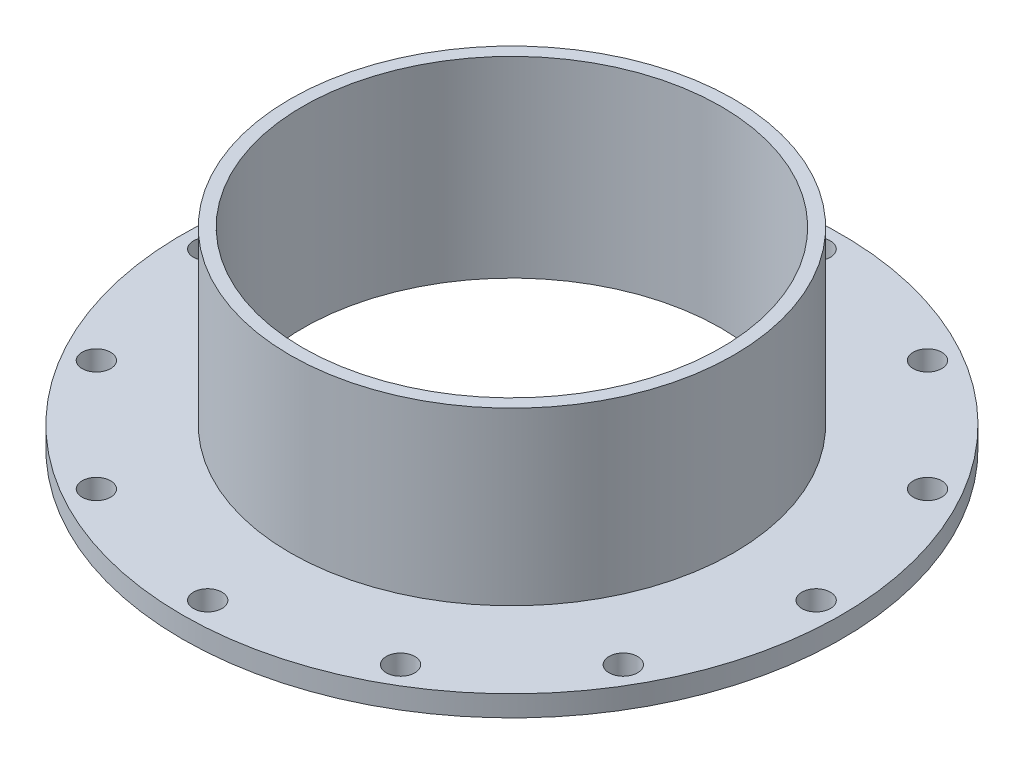
ISO-10303-21;
HEADER;
FILE_DESCRIPTION(('STEP AP214'),'2;1');
FILE_NAME('part.step','',(''),(''),'','','');
FILE_SCHEMA(('AUTOMOTIVE_DESIGN { 1 0 10303 214 1 1 1 1 }'));
ENDSEC;
DATA;
#1=APPLICATION_CONTEXT('core data for automotive mechanical design processes');
#2=APPLICATION_PROTOCOL_DEFINITION('international standard','automotive_design',2000,#1);
#3=PRODUCT_CONTEXT('',#1,'mechanical');
#4=PRODUCT('Part','Part','',(#3));
#5=PRODUCT_RELATED_PRODUCT_CATEGORY('part','',(#4));
#6=PRODUCT_DEFINITION_FORMATION('','',#4);
#7=PRODUCT_DEFINITION_CONTEXT('part definition',#1,'design');
#8=PRODUCT_DEFINITION('design','',#6,#7);
#9=PRODUCT_DEFINITION_SHAPE('','',#8);
#10=(LENGTH_UNIT() NAMED_UNIT(*) SI_UNIT(.MILLI.,.METRE.));
#11=(NAMED_UNIT(*) PLANE_ANGLE_UNIT() SI_UNIT($,.RADIAN.));
#12=(NAMED_UNIT(*) SI_UNIT($,.STERADIAN.) SOLID_ANGLE_UNIT());
#13=UNCERTAINTY_MEASURE_WITH_UNIT(LENGTH_MEASURE(1.E-05),#10,'distance_accuracy_value','');
#14=(GEOMETRIC_REPRESENTATION_CONTEXT(3) GLOBAL_UNCERTAINTY_ASSIGNED_CONTEXT((#13)) GLOBAL_UNIT_ASSIGNED_CONTEXT((#10,
#11,#12)) REPRESENTATION_CONTEXT('',''));
#15=CARTESIAN_POINT('',(0.,0.,0.));
#16=DIRECTION('',(0.,0.,1.));
#17=DIRECTION('',(1.,0.,0.));
#18=AXIS2_PLACEMENT_3D('',#15,#16,#17);
#19=CARTESIAN_POINT('',(0.,3.3,0.));
#20=DIRECTION('',(0.,1.,0.));
#21=DIRECTION('',(0.,0.,1.));
#22=AXIS2_PLACEMENT_3D('',#19,#20,#21);
#23=PLANE('',#22);
#24=CARTESIAN_POINT('',(-41.5692193816531,3.3,-23.9999999999999));
#25=DIRECTION('',(0.,1.,0.));
#26=DIRECTION('',(0.86602540378444,0.,0.499999999999998));
#27=AXIS2_PLACEMENT_3D('',#24,#25,#26);
#28=CIRCLE('',#27,2.25);
#29=CARTESIAN_POINT('',(-39.6206622231381,3.3,-22.8749999999999));
#30=VERTEX_POINT('',#29);
#31=EDGE_CURVE('E111',#30,#30,#28,.T.);
#32=ORIENTED_EDGE('',*,*,#31,.F.);
#33=EDGE_LOOP('',(#32));
#34=FACE_BOUND('',#33,.T.);
#35=CARTESIAN_POINT('',(-48.,3.3,1.6759110426447E-13));
#36=DIRECTION('',(0.,1.,0.));
#37=DIRECTION('',(1.,0.,0.));
#38=AXIS2_PLACEMENT_3D('',#35,#36,#37);
#39=CIRCLE('',#38,2.25);
#40=CARTESIAN_POINT('',(-45.75,3.3,1.59735271252073E-13));
#41=VERTEX_POINT('',#40);
#42=EDGE_CURVE('E105',#41,#41,#39,.T.);
#43=ORIENTED_EDGE('',*,*,#42,.F.);
#44=EDGE_LOOP('',(#43));
#45=FACE_BOUND('',#44,.T.);
#46=CARTESIAN_POINT('',(-41.5692193816529,3.3,24.0000000000002));
#47=DIRECTION('',(0.,1.,0.));
#48=DIRECTION('',(0.866025403784436,0.,-0.500000000000004));
#49=AXIS2_PLACEMENT_3D('',#46,#47,#48);
#50=CIRCLE('',#49,2.25);
#51=CARTESIAN_POINT('',(-39.620662223138,3.3,22.8750000000002));
#52=VERTEX_POINT('',#51);
#53=EDGE_CURVE('E99',#52,#52,#50,.T.);
#54=ORIENTED_EDGE('',*,*,#53,.F.);
#55=EDGE_LOOP('',(#54));
#56=FACE_BOUND('',#55,.T.);
#57=CARTESIAN_POINT('',(-23.9999999999998,3.3,41.5692193816532));
#58=DIRECTION('',(0.,1.,0.));
#59=DIRECTION('',(0.499999999999995,0.,-0.866025403784442));
#60=AXIS2_PLACEMENT_3D('',#57,#58,#59);
#61=CIRCLE('',#60,2.25);
#62=CARTESIAN_POINT('',(-22.8749999999998,3.3,39.6206622231382));
#63=VERTEX_POINT('',#62);
#64=EDGE_CURVE('E93',#63,#63,#61,.T.);
#65=ORIENTED_EDGE('',*,*,#64,.F.);
#66=EDGE_LOOP('',(#65));
#67=FACE_BOUND('',#66,.T.);
#68=CARTESIAN_POINT('',(0.,3.3,48.));
#69=DIRECTION('',(0.,1.,0.));
#70=DIRECTION('',(0.,0.,-1.));
#71=AXIS2_PLACEMENT_3D('',#68,#69,#70);
#72=CIRCLE('',#71,2.25);
#73=CARTESIAN_POINT('',(0.,3.3,45.75));
#74=VERTEX_POINT('',#73);
#75=EDGE_CURVE('E87',#74,#74,#72,.T.);
#76=ORIENTED_EDGE('',*,*,#75,.F.);
#77=EDGE_LOOP('',(#76));
#78=FACE_BOUND('',#77,.T.);
#79=CARTESIAN_POINT('',(24.0000000000003,3.3,41.5692193816529));
#80=DIRECTION('',(0.,1.,0.));
#81=DIRECTION('',(-0.500000000000007,0.,-0.866025403784435));
#82=AXIS2_PLACEMENT_3D('',#79,#80,#81);
#83=CIRCLE('',#82,2.25);
#84=CARTESIAN_POINT('',(22.8750000000003,3.3,39.6206622231379));
#85=VERTEX_POINT('',#84);
#86=EDGE_CURVE('E81',#85,#85,#83,.T.);
#87=ORIENTED_EDGE('',*,*,#86,.F.);
#88=EDGE_LOOP('',(#87));
#89=FACE_BOUND('',#88,.T.);
#90=CARTESIAN_POINT('',(41.5692193816533,3.3,23.9999999999996));
#91=DIRECTION('',(0.,1.,0.));
#92=DIRECTION('',(-0.866025403784443,0.,-0.499999999999992));
#93=AXIS2_PLACEMENT_3D('',#90,#91,#92);
#94=CIRCLE('',#93,2.25);
#95=CARTESIAN_POINT('',(39.6206622231383,3.3,22.8749999999996));
#96=VERTEX_POINT('',#95);
#97=EDGE_CURVE('E75',#96,#96,#94,.T.);
#98=ORIENTED_EDGE('',*,*,#97,.F.);
#99=EDGE_LOOP('',(#98));
#100=FACE_BOUND('',#99,.T.);
#101=CARTESIAN_POINT('',(48.,3.3,-5.02773312793411E-13));
#102=DIRECTION('',(0.,1.,0.));
#103=DIRECTION('',(-1.,0.,0.));
#104=AXIS2_PLACEMENT_3D('',#101,#102,#103);
#105=CIRCLE('',#104,2.25);
#106=CARTESIAN_POINT('',(45.75,3.3,-4.7920581375622E-13));
#107=VERTEX_POINT('',#106);
#108=EDGE_CURVE('E68',#107,#107,#105,.T.);
#109=ORIENTED_EDGE('',*,*,#108,.F.);
#110=EDGE_LOOP('',(#109));
#111=FACE_BOUND('',#110,.T.);
#112=CARTESIAN_POINT('',(41.5692193816528,3.3,-24.0000000000005));
#113=DIRECTION('',(0.,1.,0.));
#114=DIRECTION('',(-0.866025403784433,0.,0.50000000000001));
#115=AXIS2_PLACEMENT_3D('',#112,#113,#114);
#116=CIRCLE('',#115,2.25);
#117=CARTESIAN_POINT('',(39.6206622231378,3.3,-22.8750000000005));
#118=VERTEX_POINT('',#117);
#119=EDGE_CURVE('E122',#118,#118,#116,.T.);
#120=ORIENTED_EDGE('',*,*,#119,.F.);
#121=EDGE_LOOP('',(#120));
#122=FACE_BOUND('',#121,.T.);
#123=CARTESIAN_POINT('',(23.9999999999995,3.3,-41.5692193816534));
#124=DIRECTION('',(0.,1.,0.));
#125=DIRECTION('',(-0.499999999999989,0.,0.866025403784445));
#126=AXIS2_PLACEMENT_3D('',#123,#124,#125);
#127=CIRCLE('',#126,2.25);
#128=CARTESIAN_POINT('',(22.8749999999995,3.3,-39.6206622231384));
#129=VERTEX_POINT('',#128);
#130=EDGE_CURVE('E116',#129,#129,#127,.T.);
#131=ORIENTED_EDGE('',*,*,#130,.F.);
#132=EDGE_LOOP('',(#131));
#133=FACE_BOUND('',#132,.T.);
#134=CARTESIAN_POINT('',(-24.,3.3,-41.569219381653));
#135=DIRECTION('',(0.,1.,0.));
#136=DIRECTION('',(0.500000000000001,0.,0.866025403784438));
#137=AXIS2_PLACEMENT_3D('',#134,#135,#136);
#138=CIRCLE('',#137,2.25);
#139=CARTESIAN_POINT('',(-22.875,3.3,-39.620662223138));
#140=VERTEX_POINT('',#139);
#141=EDGE_CURVE('E62',#140,#140,#138,.T.);
#142=ORIENTED_EDGE('',*,*,#141,.F.);
#143=EDGE_LOOP('',(#142));
#144=FACE_BOUND('',#143,.T.);
#145=CARTESIAN_POINT('',(0.,3.3,-48.));
#146=DIRECTION('',(0.,1.,0.));
#147=DIRECTION('',(0.,0.,1.));
#148=AXIS2_PLACEMENT_3D('',#145,#146,#147);
#149=CIRCLE('',#148,2.25);
#150=CARTESIAN_POINT('',(0.,3.3,-45.75));
#151=VERTEX_POINT('',#150);
#152=EDGE_CURVE('E56',#151,#151,#149,.T.);
#153=ORIENTED_EDGE('',*,*,#152,.F.);
#154=EDGE_LOOP('',(#153));
#155=FACE_BOUND('',#154,.T.);
#156=CARTESIAN_POINT('',(0.,3.3,0.));
#157=DIRECTION('',(0.,1.,0.));
#158=DIRECTION('',(0.,0.,1.));
#159=AXIS2_PLACEMENT_3D('',#156,#157,#158);
#160=CIRCLE('',#159,52.);
#161=CARTESIAN_POINT('',(0.,3.3,52.));
#162=VERTEX_POINT('',#161);
#163=EDGE_CURVE('E10',#162,#162,#160,.T.);
#164=ORIENTED_EDGE('',*,*,#163,.T.);
#165=EDGE_LOOP('',(#164));
#166=FACE_BOUND('',#165,.T.);
#167=CARTESIAN_POINT('',(0.,3.3,0.));
#168=DIRECTION('',(0.,1.,0.));
#169=DIRECTION('',(0.,0.,1.));
#170=AXIS2_PLACEMENT_3D('',#167,#168,#169);
#171=CIRCLE('',#170,35.);
#172=CARTESIAN_POINT('',(0.,3.3,35.));
#173=VERTEX_POINT('',#172);
#174=EDGE_CURVE('E47',#173,#173,#171,.T.);
#175=ORIENTED_EDGE('',*,*,#174,.F.);
#176=EDGE_LOOP('',(#175));
#177=FACE_BOUND('',#176,.T.);
#178=ADVANCED_FACE('F31',(#34,#45,#56,#67,#78,#89,#100,#111,#122,#133,#144,#155,#166,#177),#23,.T.);
#179=CARTESIAN_POINT('',(0.,0.,0.));
#180=DIRECTION('',(0.,1.,0.));
#181=DIRECTION('',(0.,0.,1.));
#182=AXIS2_PLACEMENT_3D('',#179,#180,#181);
#183=PLANE('',#182);
#184=CARTESIAN_POINT('',(-41.5692193816531,0.,-23.9999999999999));
#185=DIRECTION('',(0.,1.,0.));
#186=DIRECTION('',(0.86602540378444,0.,0.499999999999998));
#187=AXIS2_PLACEMENT_3D('',#184,#185,#186);
#188=CIRCLE('',#187,2.25);
#189=CARTESIAN_POINT('',(-39.6206622231381,0.,-22.8749999999999));
#190=VERTEX_POINT('',#189);
#191=EDGE_CURVE('E65',#190,#190,#188,.T.);
#192=ORIENTED_EDGE('',*,*,#191,.T.);
#193=EDGE_LOOP('',(#192));
#194=FACE_BOUND('',#193,.T.);
#195=CARTESIAN_POINT('',(-48.,0.,1.6759110426447E-13));
#196=DIRECTION('',(0.,1.,0.));
#197=DIRECTION('',(1.,0.,0.));
#198=AXIS2_PLACEMENT_3D('',#195,#196,#197);
#199=CIRCLE('',#198,2.25);
#200=CARTESIAN_POINT('',(-45.75,0.,1.59735271252073E-13));
#201=VERTEX_POINT('',#200);
#202=EDGE_CURVE('E108',#201,#201,#199,.T.);
#203=ORIENTED_EDGE('',*,*,#202,.T.);
#204=EDGE_LOOP('',(#203));
#205=FACE_BOUND('',#204,.T.);
#206=CARTESIAN_POINT('',(-41.5692193816529,0.,24.0000000000002));
#207=DIRECTION('',(0.,1.,0.));
#208=DIRECTION('',(0.866025403784436,0.,-0.500000000000004));
#209=AXIS2_PLACEMENT_3D('',#206,#207,#208);
#210=CIRCLE('',#209,2.25);
#211=CARTESIAN_POINT('',(-39.620662223138,0.,22.8750000000002));
#212=VERTEX_POINT('',#211);
#213=EDGE_CURVE('E102',#212,#212,#210,.T.);
#214=ORIENTED_EDGE('',*,*,#213,.T.);
#215=EDGE_LOOP('',(#214));
#216=FACE_BOUND('',#215,.T.);
#217=CARTESIAN_POINT('',(-23.9999999999998,0.,41.5692193816532));
#218=DIRECTION('',(0.,1.,0.));
#219=DIRECTION('',(0.499999999999995,0.,-0.866025403784442));
#220=AXIS2_PLACEMENT_3D('',#217,#218,#219);
#221=CIRCLE('',#220,2.25);
#222=CARTESIAN_POINT('',(-22.8749999999998,0.,39.6206622231382));
#223=VERTEX_POINT('',#222);
#224=EDGE_CURVE('E96',#223,#223,#221,.T.);
#225=ORIENTED_EDGE('',*,*,#224,.T.);
#226=EDGE_LOOP('',(#225));
#227=FACE_BOUND('',#226,.T.);
#228=CARTESIAN_POINT('',(0.,0.,48.));
#229=DIRECTION('',(0.,1.,0.));
#230=DIRECTION('',(0.,0.,-1.));
#231=AXIS2_PLACEMENT_3D('',#228,#229,#230);
#232=CIRCLE('',#231,2.25);
#233=CARTESIAN_POINT('',(0.,0.,45.75));
#234=VERTEX_POINT('',#233);
#235=EDGE_CURVE('E90',#234,#234,#232,.T.);
#236=ORIENTED_EDGE('',*,*,#235,.T.);
#237=EDGE_LOOP('',(#236));
#238=FACE_BOUND('',#237,.T.);
#239=CARTESIAN_POINT('',(24.0000000000003,0.,41.5692193816529));
#240=DIRECTION('',(0.,1.,0.));
#241=DIRECTION('',(-0.500000000000007,0.,-0.866025403784435));
#242=AXIS2_PLACEMENT_3D('',#239,#240,#241);
#243=CIRCLE('',#242,2.25);
#244=CARTESIAN_POINT('',(22.8750000000003,0.,39.6206622231379));
#245=VERTEX_POINT('',#244);
#246=EDGE_CURVE('E84',#245,#245,#243,.T.);
#247=ORIENTED_EDGE('',*,*,#246,.T.);
#248=EDGE_LOOP('',(#247));
#249=FACE_BOUND('',#248,.T.);
#250=CARTESIAN_POINT('',(41.5692193816533,0.,23.9999999999996));
#251=DIRECTION('',(0.,1.,0.));
#252=DIRECTION('',(-0.866025403784443,0.,-0.499999999999992));
#253=AXIS2_PLACEMENT_3D('',#250,#251,#252);
#254=CIRCLE('',#253,2.25);
#255=CARTESIAN_POINT('',(39.6206622231383,0.,22.8749999999996));
#256=VERTEX_POINT('',#255);
#257=EDGE_CURVE('E78',#256,#256,#254,.T.);
#258=ORIENTED_EDGE('',*,*,#257,.T.);
#259=EDGE_LOOP('',(#258));
#260=FACE_BOUND('',#259,.T.);
#261=CARTESIAN_POINT('',(48.,0.,-5.02773312793411E-13));
#262=DIRECTION('',(0.,1.,0.));
#263=DIRECTION('',(-1.,0.,0.));
#264=AXIS2_PLACEMENT_3D('',#261,#262,#263);
#265=CIRCLE('',#264,2.25);
#266=CARTESIAN_POINT('',(45.75,0.,-4.7920581375622E-13));
#267=VERTEX_POINT('',#266);
#268=EDGE_CURVE('E71',#267,#267,#265,.T.);
#269=ORIENTED_EDGE('',*,*,#268,.T.);
#270=EDGE_LOOP('',(#269));
#271=FACE_BOUND('',#270,.T.);
#272=CARTESIAN_POINT('',(41.5692193816528,0.,-24.0000000000005));
#273=DIRECTION('',(0.,1.,0.));
#274=DIRECTION('',(-0.866025403784433,0.,0.50000000000001));
#275=AXIS2_PLACEMENT_3D('',#272,#273,#274);
#276=CIRCLE('',#275,2.25);
#277=CARTESIAN_POINT('',(39.6206622231378,0.,-22.8750000000005));
#278=VERTEX_POINT('',#277);
#279=EDGE_CURVE('E72',#278,#278,#276,.T.);
#280=ORIENTED_EDGE('',*,*,#279,.T.);
#281=EDGE_LOOP('',(#280));
#282=FACE_BOUND('',#281,.T.);
#283=CARTESIAN_POINT('',(23.9999999999995,0.,-41.5692193816534));
#284=DIRECTION('',(0.,1.,0.));
#285=DIRECTION('',(-0.499999999999989,0.,0.866025403784445));
#286=AXIS2_PLACEMENT_3D('',#283,#284,#285);
#287=CIRCLE('',#286,2.25);
#288=CARTESIAN_POINT('',(22.8749999999995,0.,-39.6206622231384));
#289=VERTEX_POINT('',#288);
#290=EDGE_CURVE('E119',#289,#289,#287,.T.);
#291=ORIENTED_EDGE('',*,*,#290,.T.);
#292=EDGE_LOOP('',(#291));
#293=FACE_BOUND('',#292,.T.);
#294=CARTESIAN_POINT('',(-24.,0.,-41.569219381653));
#295=DIRECTION('',(0.,1.,0.));
#296=DIRECTION('',(0.500000000000001,0.,0.866025403784438));
#297=AXIS2_PLACEMENT_3D('',#294,#295,#296);
#298=CIRCLE('',#297,2.25);
#299=CARTESIAN_POINT('',(-22.875,0.,-39.620662223138));
#300=VERTEX_POINT('',#299);
#301=EDGE_CURVE('E59',#300,#300,#298,.T.);
#302=ORIENTED_EDGE('',*,*,#301,.T.);
#303=EDGE_LOOP('',(#302));
#304=FACE_BOUND('',#303,.T.);
#305=CARTESIAN_POINT('',(0.,0.,-48.));
#306=DIRECTION('',(0.,1.,0.));
#307=DIRECTION('',(0.,0.,1.));
#308=AXIS2_PLACEMENT_3D('',#305,#306,#307);
#309=CIRCLE('',#308,2.25);
#310=CARTESIAN_POINT('',(0.,0.,-45.75));
#311=VERTEX_POINT('',#310);
#312=EDGE_CURVE('E55',#311,#311,#309,.T.);
#313=ORIENTED_EDGE('',*,*,#312,.T.);
#314=EDGE_LOOP('',(#313));
#315=FACE_BOUND('',#314,.T.);
#316=CARTESIAN_POINT('',(0.,0.,0.));
#317=DIRECTION('',(0.,1.,0.));
#318=DIRECTION('',(0.,0.,1.));
#319=AXIS2_PLACEMENT_3D('',#316,#317,#318);
#320=CIRCLE('',#319,52.);
#321=CARTESIAN_POINT('',(0.,0.,52.));
#322=VERTEX_POINT('',#321);
#323=EDGE_CURVE('E35',#322,#322,#320,.T.);
#324=ORIENTED_EDGE('',*,*,#323,.F.);
#325=EDGE_LOOP('',(#324));
#326=FACE_BOUND('',#325,.T.);
#327=CARTESIAN_POINT('',(0.,0.,0.));
#328=DIRECTION('',(0.,1.,0.));
#329=DIRECTION('',(0.,0.,1.));
#330=AXIS2_PLACEMENT_3D('',#327,#328,#329);
#331=CIRCLE('',#330,33.);
#332=CARTESIAN_POINT('',(0.,0.,33.));
#333=VERTEX_POINT('',#332);
#334=EDGE_CURVE('E42',#333,#333,#331,.T.);
#335=ORIENTED_EDGE('',*,*,#334,.T.);
#336=EDGE_LOOP('',(#335));
#337=FACE_BOUND('',#336,.T.);
#338=ADVANCED_FACE('F128',(#194,#205,#216,#227,#238,#249,#260,#271,#282,#293,#304,#315,#326,
#337),#183,.F.);
#339=CARTESIAN_POINT('',(0.,3.3,0.));
#340=DIRECTION('',(0.,-1.,0.));
#341=DIRECTION('',(0.,0.,-1.));
#342=AXIS2_PLACEMENT_3D('',#339,#340,#341);
#343=CYLINDRICAL_SURFACE('',#342,52.);
#344=ORIENTED_EDGE('',*,*,#163,.F.);
#345=EDGE_LOOP('',(#344));
#346=FACE_BOUND('',#345,.T.);
#347=ORIENTED_EDGE('',*,*,#323,.T.);
#348=EDGE_LOOP('',(#347));
#349=FACE_BOUND('',#348,.T.);
#350=ADVANCED_FACE('F33',(#346,#349),#343,.T.);
#351=CARTESIAN_POINT('',(0.,3.3,0.));
#352=DIRECTION('',(0.,-1.,0.));
#353=DIRECTION('',(0.,0.,-1.));
#354=AXIS2_PLACEMENT_3D('',#351,#352,#353);
#355=CYLINDRICAL_SURFACE('',#354,33.);
#356=ORIENTED_EDGE('',*,*,#334,.F.);
#357=EDGE_LOOP('',(#356));
#358=FACE_BOUND('',#357,.T.);
#359=CARTESIAN_POINT('',(0.,30.3,0.));
#360=DIRECTION('',(0.,1.,0.));
#361=DIRECTION('',(0.,0.,1.));
#362=AXIS2_PLACEMENT_3D('',#359,#360,#361);
#363=CIRCLE('',#362,33.);
#364=CARTESIAN_POINT('',(0.,30.3,33.));
#365=VERTEX_POINT('',#364);
#366=EDGE_CURVE('E50',#365,#365,#363,.T.);
#367=ORIENTED_EDGE('',*,*,#366,.T.);
#368=EDGE_LOOP('',(#367));
#369=FACE_BOUND('',#368,.T.);
#370=ADVANCED_FACE('F164',(#358,#369),#355,.F.);
#371=CARTESIAN_POINT('',(0.,30.3,0.));
#372=DIRECTION('',(0.,1.,0.));
#373=DIRECTION('',(0.,0.,1.));
#374=AXIS2_PLACEMENT_3D('',#371,#372,#373);
#375=PLANE('',#374);
#376=CARTESIAN_POINT('',(0.,30.3,0.));
#377=DIRECTION('',(0.,1.,0.));
#378=DIRECTION('',(0.,0.,1.));
#379=AXIS2_PLACEMENT_3D('',#376,#377,#378);
#380=CIRCLE('',#379,35.);
#381=CARTESIAN_POINT('',(0.,30.3,35.));
#382=VERTEX_POINT('',#381);
#383=EDGE_CURVE('E46',#382,#382,#380,.T.);
#384=ORIENTED_EDGE('',*,*,#383,.T.);
#385=EDGE_LOOP('',(#384));
#386=FACE_BOUND('',#385,.T.);
#387=ORIENTED_EDGE('',*,*,#366,.F.);
#388=EDGE_LOOP('',(#387));
#389=FACE_BOUND('',#388,.T.);
#390=ADVANCED_FACE('F154',(#386,#389),#375,.T.);
#391=CARTESIAN_POINT('',(0.,30.3,0.));
#392=DIRECTION('',(0.,-1.,0.));
#393=DIRECTION('',(0.,0.,-1.));
#394=AXIS2_PLACEMENT_3D('',#391,#392,#393);
#395=CYLINDRICAL_SURFACE('',#394,35.);
#396=ORIENTED_EDGE('',*,*,#383,.F.);
#397=EDGE_LOOP('',(#396));
#398=FACE_BOUND('',#397,.T.);
#399=ORIENTED_EDGE('',*,*,#174,.T.);
#400=EDGE_LOOP('',(#399));
#401=FACE_BOUND('',#400,.T.);
#402=ADVANCED_FACE('F151',(#398,#401),#395,.T.);
#403=CARTESIAN_POINT('',(0.,0.,-48.));
#404=DIRECTION('',(0.,1.,0.));
#405=DIRECTION('',(0.,0.,1.));
#406=AXIS2_PLACEMENT_3D('',#403,#404,#405);
#407=CYLINDRICAL_SURFACE('',#406,2.25);
#408=ORIENTED_EDGE('',*,*,#312,.F.);
#409=EDGE_LOOP('',(#408));
#410=FACE_BOUND('',#409,.T.);
#411=ORIENTED_EDGE('',*,*,#152,.T.);
#412=EDGE_LOOP('',(#411));
#413=FACE_BOUND('',#412,.T.);
#414=ADVANCED_FACE('F153',(#410,#413),#407,.F.);
#415=CARTESIAN_POINT('',(-24.,0.,-41.569219381653));
#416=DIRECTION('',(0.,1.,0.));
#417=DIRECTION('',(0.,0.,1.));
#418=AXIS2_PLACEMENT_3D('',#415,#416,#417);
#419=CYLINDRICAL_SURFACE('',#418,2.25);
#420=ORIENTED_EDGE('',*,*,#301,.F.);
#421=EDGE_LOOP('',(#420));
#422=FACE_BOUND('',#421,.T.);
#423=ORIENTED_EDGE('',*,*,#141,.T.);
#424=EDGE_LOOP('',(#423));
#425=FACE_BOUND('',#424,.T.);
#426=ADVANCED_FACE('F161',(#422,#425),#419,.F.);
#427=CARTESIAN_POINT('',(23.9999999999995,0.,-41.5692193816534));
#428=DIRECTION('',(0.,1.,0.));
#429=DIRECTION('',(0.,0.,1.));
#430=AXIS2_PLACEMENT_3D('',#427,#428,#429);
#431=CYLINDRICAL_SURFACE('',#430,2.25);
#432=ORIENTED_EDGE('',*,*,#290,.F.);
#433=EDGE_LOOP('',(#432));
#434=FACE_BOUND('',#433,.T.);
#435=ORIENTED_EDGE('',*,*,#130,.T.);
#436=EDGE_LOOP('',(#435));
#437=FACE_BOUND('',#436,.T.);
#438=ADVANCED_FACE('F135',(#434,#437),#431,.F.);
#439=CARTESIAN_POINT('',(41.5692193816528,0.,-24.0000000000005));
#440=DIRECTION('',(0.,1.,0.));
#441=DIRECTION('',(0.,0.,1.));
#442=AXIS2_PLACEMENT_3D('',#439,#440,#441);
#443=CYLINDRICAL_SURFACE('',#442,2.25);
#444=ORIENTED_EDGE('',*,*,#279,.F.);
#445=EDGE_LOOP('',(#444));
#446=FACE_BOUND('',#445,.T.);
#447=ORIENTED_EDGE('',*,*,#119,.T.);
#448=EDGE_LOOP('',(#447));
#449=FACE_BOUND('',#448,.T.);
#450=ADVANCED_FACE('F131',(#446,#449),#443,.F.);
#451=CARTESIAN_POINT('',(48.,0.,-5.02773312793411E-13));
#452=DIRECTION('',(0.,1.,0.));
#453=DIRECTION('',(0.,0.,1.));
#454=AXIS2_PLACEMENT_3D('',#451,#452,#453);
#455=CYLINDRICAL_SURFACE('',#454,2.25);
#456=ORIENTED_EDGE('',*,*,#268,.F.);
#457=EDGE_LOOP('',(#456));
#458=FACE_BOUND('',#457,.T.);
#459=ORIENTED_EDGE('',*,*,#108,.T.);
#460=EDGE_LOOP('',(#459));
#461=FACE_BOUND('',#460,.T.);
#462=ADVANCED_FACE('F134',(#458,#461),#455,.F.);
#463=CARTESIAN_POINT('',(41.5692193816533,0.,23.9999999999996));
#464=DIRECTION('',(0.,1.,0.));
#465=DIRECTION('',(0.,0.,1.));
#466=AXIS2_PLACEMENT_3D('',#463,#464,#465);
#467=CYLINDRICAL_SURFACE('',#466,2.25);
#468=ORIENTED_EDGE('',*,*,#257,.F.);
#469=EDGE_LOOP('',(#468));
#470=FACE_BOUND('',#469,.T.);
#471=ORIENTED_EDGE('',*,*,#97,.T.);
#472=EDGE_LOOP('',(#471));
#473=FACE_BOUND('',#472,.T.);
#474=ADVANCED_FACE('F195',(#470,#473),#467,.F.);
#475=CARTESIAN_POINT('',(24.0000000000003,0.,41.5692193816529));
#476=DIRECTION('',(0.,1.,0.));
#477=DIRECTION('',(0.,0.,1.));
#478=AXIS2_PLACEMENT_3D('',#475,#476,#477);
#479=CYLINDRICAL_SURFACE('',#478,2.25);
#480=ORIENTED_EDGE('',*,*,#246,.F.);
#481=EDGE_LOOP('',(#480));
#482=FACE_BOUND('',#481,.T.);
#483=ORIENTED_EDGE('',*,*,#86,.T.);
#484=EDGE_LOOP('',(#483));
#485=FACE_BOUND('',#484,.T.);
#486=ADVANCED_FACE('F202',(#482,#485),#479,.F.);
#487=CARTESIAN_POINT('',(0.,0.,48.));
#488=DIRECTION('',(0.,1.,0.));
#489=DIRECTION('',(0.,0.,1.));
#490=AXIS2_PLACEMENT_3D('',#487,#488,#489);
#491=CYLINDRICAL_SURFACE('',#490,2.25);
#492=ORIENTED_EDGE('',*,*,#235,.F.);
#493=EDGE_LOOP('',(#492));
#494=FACE_BOUND('',#493,.T.);
#495=ORIENTED_EDGE('',*,*,#75,.T.);
#496=EDGE_LOOP('',(#495));
#497=FACE_BOUND('',#496,.T.);
#498=ADVANCED_FACE('F248',(#494,#497),#491,.F.);
#499=CARTESIAN_POINT('',(-23.9999999999998,0.,41.5692193816532));
#500=DIRECTION('',(0.,1.,0.));
#501=DIRECTION('',(0.,0.,1.));
#502=AXIS2_PLACEMENT_3D('',#499,#500,#501);
#503=CYLINDRICAL_SURFACE('',#502,2.25);
#504=ORIENTED_EDGE('',*,*,#224,.F.);
#505=EDGE_LOOP('',(#504));
#506=FACE_BOUND('',#505,.T.);
#507=ORIENTED_EDGE('',*,*,#64,.T.);
#508=EDGE_LOOP('',(#507));
#509=FACE_BOUND('',#508,.T.);
#510=ADVANCED_FACE('F244',(#506,#509),#503,.F.);
#511=CARTESIAN_POINT('',(-41.5692193816529,0.,24.0000000000002));
#512=DIRECTION('',(0.,1.,0.));
#513=DIRECTION('',(0.,0.,1.));
#514=AXIS2_PLACEMENT_3D('',#511,#512,#513);
#515=CYLINDRICAL_SURFACE('',#514,2.25);
#516=ORIENTED_EDGE('',*,*,#213,.F.);
#517=EDGE_LOOP('',(#516));
#518=FACE_BOUND('',#517,.T.);
#519=ORIENTED_EDGE('',*,*,#53,.T.);
#520=EDGE_LOOP('',(#519));
#521=FACE_BOUND('',#520,.T.);
#522=ADVANCED_FACE('F240',(#518,#521),#515,.F.);
#523=CARTESIAN_POINT('',(-48.,0.,1.6759110426447E-13));
#524=DIRECTION('',(0.,1.,0.));
#525=DIRECTION('',(0.,0.,1.));
#526=AXIS2_PLACEMENT_3D('',#523,#524,#525);
#527=CYLINDRICAL_SURFACE('',#526,2.25);
#528=ORIENTED_EDGE('',*,*,#202,.F.);
#529=EDGE_LOOP('',(#528));
#530=FACE_BOUND('',#529,.T.);
#531=ORIENTED_EDGE('',*,*,#42,.T.);
#532=EDGE_LOOP('',(#531));
#533=FACE_BOUND('',#532,.T.);
#534=ADVANCED_FACE('F236',(#530,#533),#527,.F.);
#535=CARTESIAN_POINT('',(-41.5692193816531,0.,-23.9999999999999));
#536=DIRECTION('',(0.,1.,0.));
#537=DIRECTION('',(0.,0.,1.));
#538=AXIS2_PLACEMENT_3D('',#535,#536,#537);
#539=CYLINDRICAL_SURFACE('',#538,2.25);
#540=ORIENTED_EDGE('',*,*,#191,.F.);
#541=EDGE_LOOP('',(#540));
#542=FACE_BOUND('',#541,.T.);
#543=ORIENTED_EDGE('',*,*,#31,.T.);
#544=EDGE_LOOP('',(#543));
#545=FACE_BOUND('',#544,.T.);
#546=ADVANCED_FACE('F233',(#542,#545),#539,.F.);
#547=CLOSED_SHELL('',(#178,#338,#350,#370,#390,#402,#414,#426,#438,#450,#462,#474,#486,#498,
#510,#522,#534,#546));
#548=MANIFOLD_SOLID_BREP('B2',#547);
#549=ADVANCED_BREP_SHAPE_REPRESENTATION('',(#18,#548),#14);
#550=SHAPE_DEFINITION_REPRESENTATION(#9,#549);
ENDSEC;
END-ISO-10303-21;
